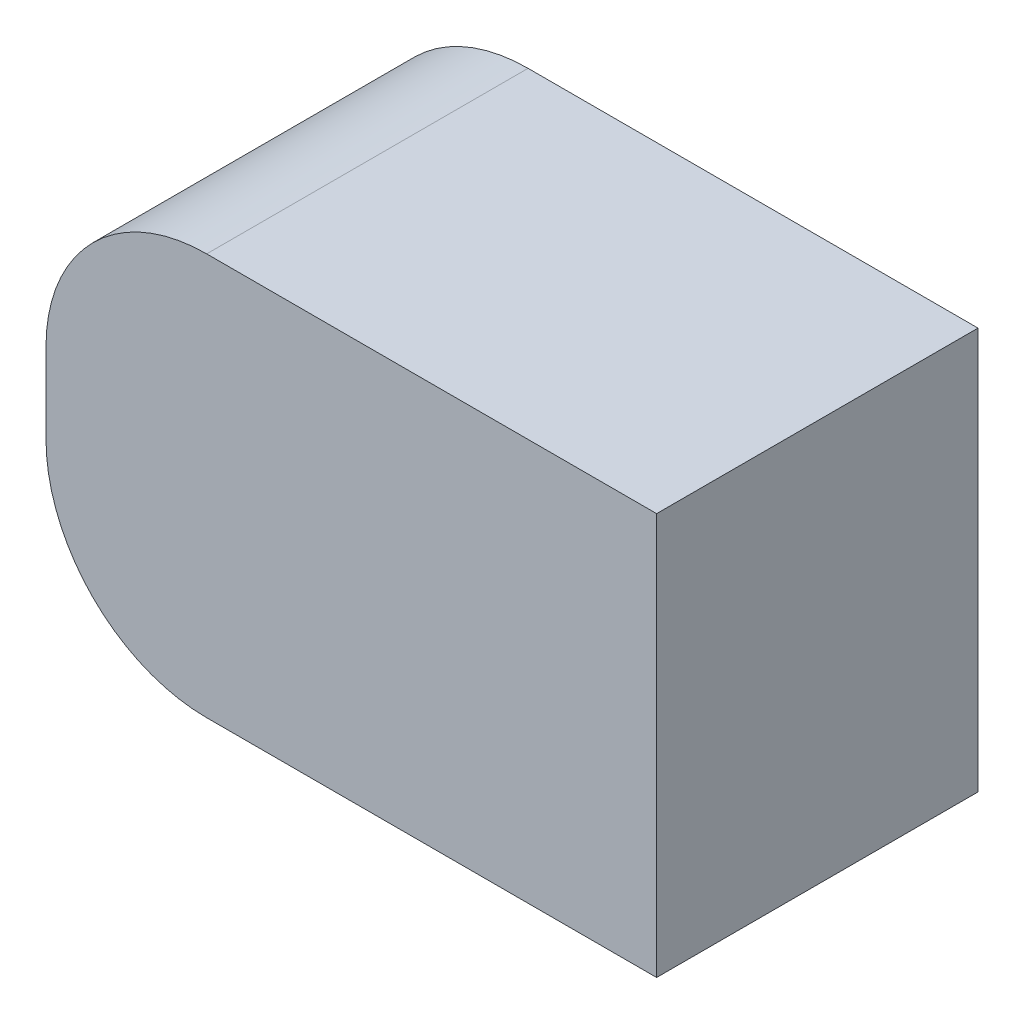
ISO-10303-21;
HEADER;
FILE_DESCRIPTION(('STEP AP214'),'2;1');
FILE_NAME('part.step','',(''),(''),'','','');
FILE_SCHEMA(('AUTOMOTIVE_DESIGN { 1 0 10303 214 1 1 1 1 }'));
ENDSEC;
DATA;
#1=APPLICATION_CONTEXT('core data for automotive mechanical design processes');
#2=APPLICATION_PROTOCOL_DEFINITION('international standard','automotive_design',2000,#1);
#3=PRODUCT_CONTEXT('',#1,'mechanical');
#4=PRODUCT('Part','Part','',(#3));
#5=PRODUCT_RELATED_PRODUCT_CATEGORY('part','',(#4));
#6=PRODUCT_DEFINITION_FORMATION('','',#4);
#7=PRODUCT_DEFINITION_CONTEXT('part definition',#1,'design');
#8=PRODUCT_DEFINITION('design','',#6,#7);
#9=PRODUCT_DEFINITION_SHAPE('','',#8);
#10=(LENGTH_UNIT() NAMED_UNIT(*) SI_UNIT(.MILLI.,.METRE.));
#11=(NAMED_UNIT(*) PLANE_ANGLE_UNIT() SI_UNIT($,.RADIAN.));
#12=(NAMED_UNIT(*) SI_UNIT($,.STERADIAN.) SOLID_ANGLE_UNIT());
#13=UNCERTAINTY_MEASURE_WITH_UNIT(LENGTH_MEASURE(1.E-05),#10,'distance_accuracy_value','');
#14=(GEOMETRIC_REPRESENTATION_CONTEXT(3) GLOBAL_UNCERTAINTY_ASSIGNED_CONTEXT((#13)) GLOBAL_UNIT_ASSIGNED_CONTEXT((#10,
#11,#12)) REPRESENTATION_CONTEXT('',''));
#15=CARTESIAN_POINT('',(0.,0.,0.));
#16=DIRECTION('',(0.,0.,1.));
#17=DIRECTION('',(1.,0.,0.));
#18=AXIS2_PLACEMENT_3D('',#15,#16,#17);
#19=CARTESIAN_POINT('',(1.223,0.525,0.));
#20=DIRECTION('',(0.,0.,-1.));
#21=DIRECTION('',(-0.707106781186548,0.707106781186547,0.));
#22=AXIS2_PLACEMENT_3D('',#19,#20,#21);
#23=CYLINDRICAL_SURFACE('',#22,0.1);
#24=CARTESIAN_POINT('',(1.223,0.525,0.2));
#25=DIRECTION('',(0.,0.,1.));
#26=DIRECTION('',(-0.707106781186548,0.707106781186547,0.));
#27=AXIS2_PLACEMENT_3D('',#24,#25,#26);
#28=CIRCLE('',#27,0.1);
#29=CARTESIAN_POINT('',(1.223,0.625,0.2));
#30=VERTEX_POINT('',#29);
#31=CARTESIAN_POINT('',(1.123,0.525,0.2));
#32=VERTEX_POINT('',#31);
#33=EDGE_CURVE('E11',#30,#32,#28,.T.);
#34=ORIENTED_EDGE('',*,*,#33,.F.);
#35=DIRECTION('',(0.,0.,1.));
#36=VECTOR('',#35,1.);
#37=CARTESIAN_POINT('',(1.223,0.625,0.));
#38=LINE('',#37,#36);
#39=CARTESIAN_POINT('',(1.223,0.625,0.));
#40=VERTEX_POINT('',#39);
#41=EDGE_CURVE('E24',#40,#30,#38,.T.);
#42=ORIENTED_EDGE('',*,*,#41,.F.);
#43=CARTESIAN_POINT('',(1.223,0.525,0.));
#44=DIRECTION('',(0.,0.,-1.));
#45=DIRECTION('',(-0.707106781186548,0.707106781186547,0.));
#46=AXIS2_PLACEMENT_3D('',#43,#44,#45);
#47=CIRCLE('',#46,0.1);
#48=CARTESIAN_POINT('',(1.123,0.525,0.));
#49=VERTEX_POINT('',#48);
#50=EDGE_CURVE('E114',#49,#40,#47,.T.);
#51=ORIENTED_EDGE('',*,*,#50,.F.);
#52=DIRECTION('',(0.,0.,-1.));
#53=VECTOR('',#52,1.);
#54=CARTESIAN_POINT('',(1.123,0.525,0.));
#55=LINE('',#54,#53);
#56=EDGE_CURVE('E111',#32,#49,#55,.T.);
#57=ORIENTED_EDGE('',*,*,#56,.F.);
#58=EDGE_LOOP('',(#34,#42,#51,#57));
#59=FACE_BOUND('',#58,.T.);
#60=ADVANCED_FACE('F17',(#59),#23,.T.);
#61=CARTESIAN_POINT('',(1.313,0.5,0.));
#62=DIRECTION('',(0.,0.,-1.));
#63=DIRECTION('',(-1.,0.,0.));
#64=AXIS2_PLACEMENT_3D('',#61,#62,#63);
#65=PLANE('',#64);
#66=ORIENTED_EDGE('',*,*,#50,.T.);
#67=DIRECTION('',(1.,0.,0.));
#68=VECTOR('',#67,1.);
#69=CARTESIAN_POINT('',(1.123,0.625,0.));
#70=LINE('',#69,#68);
#71=CARTESIAN_POINT('',(1.503,0.625,0.));
#72=VERTEX_POINT('',#71);
#73=EDGE_CURVE('E109',#40,#72,#70,.T.);
#74=ORIENTED_EDGE('',*,*,#73,.T.);
#75=DIRECTION('',(0.,-1.,0.));
#76=VECTOR('',#75,1.);
#77=CARTESIAN_POINT('',(1.503,0.625,0.));
#78=LINE('',#77,#76);
#79=CARTESIAN_POINT('',(1.503,0.375,0.));
#80=VERTEX_POINT('',#79);
#81=EDGE_CURVE('E107',#72,#80,#78,.T.);
#82=ORIENTED_EDGE('',*,*,#81,.T.);
#83=DIRECTION('',(-1.,0.,0.));
#84=VECTOR('',#83,1.);
#85=CARTESIAN_POINT('',(1.503,0.375,0.));
#86=LINE('',#85,#84);
#87=CARTESIAN_POINT('',(1.223,0.375000000000014,0.));
#88=VERTEX_POINT('',#87);
#89=EDGE_CURVE('E72',#80,#88,#86,.T.);
#90=ORIENTED_EDGE('',*,*,#89,.T.);
#91=CARTESIAN_POINT('',(1.223,0.475000000000014,0.));
#92=DIRECTION('',(0.,0.,-1.));
#93=DIRECTION('',(-0.707106781186565,-0.70710678118653,0.));
#94=AXIS2_PLACEMENT_3D('',#91,#92,#93);
#95=CIRCLE('',#94,0.1);
#96=CARTESIAN_POINT('',(1.123,0.475000000000014,0.));
#97=VERTEX_POINT('',#96);
#98=EDGE_CURVE('E104',#88,#97,#95,.T.);
#99=ORIENTED_EDGE('',*,*,#98,.T.);
#100=DIRECTION('',(0.,1.,0.));
#101=VECTOR('',#100,1.);
#102=CARTESIAN_POINT('',(1.123,0.375,0.));
#103=LINE('',#102,#101);
#104=EDGE_CURVE('E101',#97,#49,#103,.T.);
#105=ORIENTED_EDGE('',*,*,#104,.T.);
#106=EDGE_LOOP('',(#66,#74,#82,#90,#99,#105));
#107=FACE_BOUND('',#106,.T.);
#108=ADVANCED_FACE('F120',(#107),#65,.T.);
#109=CARTESIAN_POINT('',(1.123,0.375,0.));
#110=DIRECTION('',(1.,0.,0.));
#111=DIRECTION('',(0.,1.,0.));
#112=AXIS2_PLACEMENT_3D('',#109,#110,#111);
#113=PLANE('',#112);
#114=ORIENTED_EDGE('',*,*,#56,.T.);
#115=ORIENTED_EDGE('',*,*,#104,.F.);
#116=DIRECTION('',(0.,0.,1.));
#117=VECTOR('',#116,1.);
#118=CARTESIAN_POINT('',(1.123,0.475000000000014,0.));
#119=LINE('',#118,#117);
#120=CARTESIAN_POINT('',(1.123,0.475000000000014,0.2));
#121=VERTEX_POINT('',#120);
#122=EDGE_CURVE('E99',#97,#121,#119,.T.);
#123=ORIENTED_EDGE('',*,*,#122,.T.);
#124=DIRECTION('',(0.,1.,0.));
#125=VECTOR('',#124,1.);
#126=CARTESIAN_POINT('',(1.123,0.375,0.2));
#127=LINE('',#126,#125);
#128=EDGE_CURVE('E96',#121,#32,#127,.T.);
#129=ORIENTED_EDGE('',*,*,#128,.T.);
#130=EDGE_LOOP('',(#114,#115,#123,#129));
#131=FACE_BOUND('',#130,.T.);
#132=ADVANCED_FACE('F125',(#131),#113,.F.);
#133=CARTESIAN_POINT('',(1.223,0.475000000000014,0.));
#134=DIRECTION('',(0.,0.,-1.));
#135=DIRECTION('',(-0.707106781186565,-0.70710678118653,0.));
#136=AXIS2_PLACEMENT_3D('',#133,#134,#135);
#137=CYLINDRICAL_SURFACE('',#136,0.1);
#138=CARTESIAN_POINT('',(1.223,0.475000000000014,0.2));
#139=DIRECTION('',(0.,0.,1.));
#140=DIRECTION('',(-0.707106781186565,-0.70710678118653,0.));
#141=AXIS2_PLACEMENT_3D('',#138,#139,#140);
#142=CIRCLE('',#141,0.1);
#143=CARTESIAN_POINT('',(1.223,0.375000000000014,0.2));
#144=VERTEX_POINT('',#143);
#145=EDGE_CURVE('E82',#121,#144,#142,.T.);
#146=ORIENTED_EDGE('',*,*,#145,.F.);
#147=ORIENTED_EDGE('',*,*,#122,.F.);
#148=ORIENTED_EDGE('',*,*,#98,.F.);
#149=DIRECTION('',(0.,0.,-1.));
#150=VECTOR('',#149,1.);
#151=CARTESIAN_POINT('',(1.223,0.375000000000014,0.));
#152=LINE('',#151,#150);
#153=EDGE_CURVE('E93',#144,#88,#152,.T.);
#154=ORIENTED_EDGE('',*,*,#153,.F.);
#155=EDGE_LOOP('',(#146,#147,#148,#154));
#156=FACE_BOUND('',#155,.T.);
#157=ADVANCED_FACE('F127',(#156),#137,.T.);
#158=CARTESIAN_POINT('',(1.123,0.625,0.));
#159=DIRECTION('',(0.,-1.,0.));
#160=DIRECTION('',(1.,0.,0.));
#161=AXIS2_PLACEMENT_3D('',#158,#159,#160);
#162=PLANE('',#161);
#163=ORIENTED_EDGE('',*,*,#41,.T.);
#164=DIRECTION('',(1.,0.,0.));
#165=VECTOR('',#164,1.);
#166=CARTESIAN_POINT('',(1.123,0.625,0.2));
#167=LINE('',#166,#165);
#168=CARTESIAN_POINT('',(1.503,0.625,0.2));
#169=VERTEX_POINT('',#168);
#170=EDGE_CURVE('E91',#30,#169,#167,.T.);
#171=ORIENTED_EDGE('',*,*,#170,.T.);
#172=DIRECTION('',(0.,0.,1.));
#173=VECTOR('',#172,1.);
#174=CARTESIAN_POINT('',(1.503,0.625,0.));
#175=LINE('',#174,#173);
#176=EDGE_CURVE('E76',#72,#169,#175,.T.);
#177=ORIENTED_EDGE('',*,*,#176,.F.);
#178=ORIENTED_EDGE('',*,*,#73,.F.);
#179=EDGE_LOOP('',(#163,#171,#177,#178));
#180=FACE_BOUND('',#179,.T.);
#181=ADVANCED_FACE('F118',(#180),#162,.F.);
#182=CARTESIAN_POINT('',(1.503,0.375,0.));
#183=DIRECTION('',(0.,1.,0.));
#184=DIRECTION('',(-1.,0.,0.));
#185=AXIS2_PLACEMENT_3D('',#182,#183,#184);
#186=PLANE('',#185);
#187=ORIENTED_EDGE('',*,*,#153,.T.);
#188=ORIENTED_EDGE('',*,*,#89,.F.);
#189=DIRECTION('',(0.,0.,1.));
#190=VECTOR('',#189,1.);
#191=CARTESIAN_POINT('',(1.503,0.375,0.));
#192=LINE('',#191,#190);
#193=CARTESIAN_POINT('',(1.503,0.375,0.2));
#194=VERTEX_POINT('',#193);
#195=EDGE_CURVE('E67',#80,#194,#192,.T.);
#196=ORIENTED_EDGE('',*,*,#195,.T.);
#197=DIRECTION('',(-1.,0.,0.));
#198=VECTOR('',#197,1.);
#199=CARTESIAN_POINT('',(1.503,0.375,0.2));
#200=LINE('',#199,#198);
#201=EDGE_CURVE('E71',#194,#144,#200,.T.);
#202=ORIENTED_EDGE('',*,*,#201,.T.);
#203=EDGE_LOOP('',(#187,#188,#196,#202));
#204=FACE_BOUND('',#203,.T.);
#205=ADVANCED_FACE('F70',(#204),#186,.F.);
#206=CARTESIAN_POINT('',(1.503,0.625,0.));
#207=DIRECTION('',(-1.,0.,0.));
#208=DIRECTION('',(0.,-1.,0.));
#209=AXIS2_PLACEMENT_3D('',#206,#207,#208);
#210=PLANE('',#209);
#211=ORIENTED_EDGE('',*,*,#81,.F.);
#212=ORIENTED_EDGE('',*,*,#176,.T.);
#213=DIRECTION('',(0.,-1.,0.));
#214=VECTOR('',#213,1.);
#215=CARTESIAN_POINT('',(1.503,0.625,0.2));
#216=LINE('',#215,#214);
#217=EDGE_CURVE('E80',#169,#194,#216,.T.);
#218=ORIENTED_EDGE('',*,*,#217,.T.);
#219=ORIENTED_EDGE('',*,*,#195,.F.);
#220=EDGE_LOOP('',(#211,#212,#218,#219));
#221=FACE_BOUND('',#220,.T.);
#222=ADVANCED_FACE('F86',(#221),#210,.F.);
#223=CARTESIAN_POINT('',(1.313,0.5,0.2));
#224=DIRECTION('',(0.,0.,-1.));
#225=DIRECTION('',(-1.,0.,0.));
#226=AXIS2_PLACEMENT_3D('',#223,#224,#225);
#227=PLANE('',#226);
#228=ORIENTED_EDGE('',*,*,#33,.T.);
#229=ORIENTED_EDGE('',*,*,#128,.F.);
#230=ORIENTED_EDGE('',*,*,#145,.T.);
#231=ORIENTED_EDGE('',*,*,#201,.F.);
#232=ORIENTED_EDGE('',*,*,#217,.F.);
#233=ORIENTED_EDGE('',*,*,#170,.F.);
#234=EDGE_LOOP('',(#228,#229,#230,#231,#232,#233));
#235=FACE_BOUND('',#234,.T.);
#236=ADVANCED_FACE('F79',(#235),#227,.F.);
#237=CLOSED_SHELL('',(#60,#108,#132,#157,#181,#205,#222,#236));
#238=MANIFOLD_SOLID_BREP('B1',#237);
#239=ADVANCED_BREP_SHAPE_REPRESENTATION('',(#18,#238),#14);
#240=SHAPE_DEFINITION_REPRESENTATION(#9,#239);
ENDSEC;
END-ISO-10303-21;
